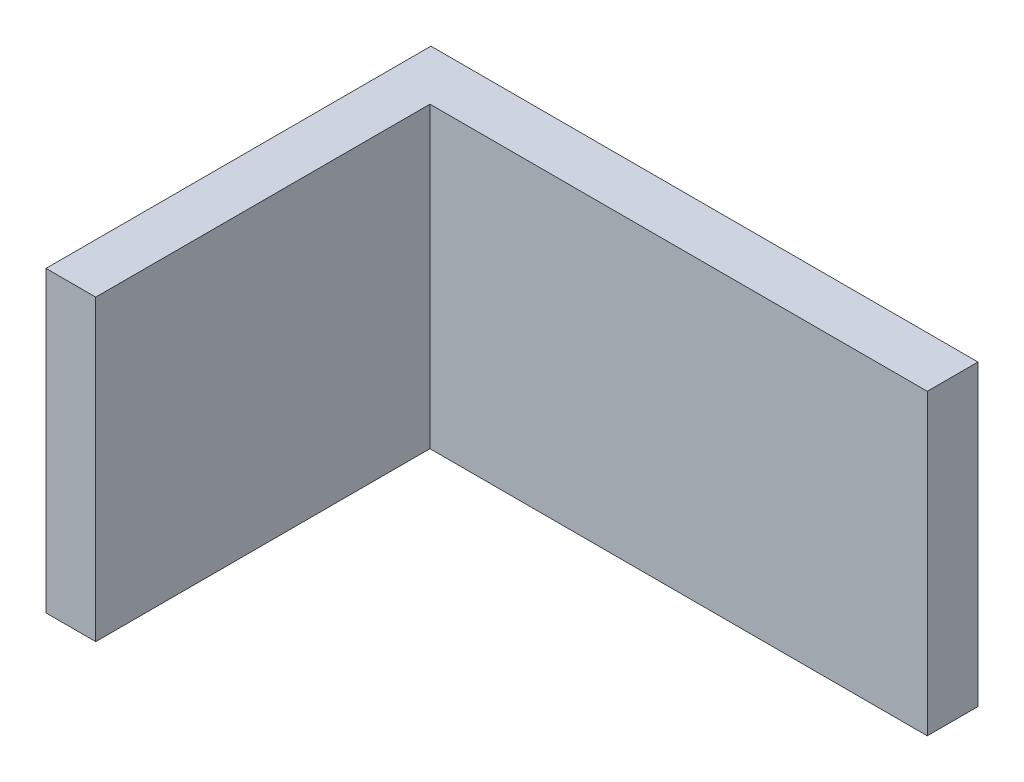
ISO-10303-21;
HEADER;
FILE_DESCRIPTION(('STEP AP214'),'2;1');
FILE_NAME('part.step','',(''),(''),'','','');
FILE_SCHEMA(('AUTOMOTIVE_DESIGN { 1 0 10303 214 1 1 1 1 }'));
ENDSEC;
DATA;
#1=APPLICATION_CONTEXT('core data for automotive mechanical design processes');
#2=APPLICATION_PROTOCOL_DEFINITION('international standard','automotive_design',2000,#1);
#3=PRODUCT_CONTEXT('',#1,'mechanical');
#4=PRODUCT('Part','Part','',(#3));
#5=PRODUCT_RELATED_PRODUCT_CATEGORY('part','',(#4));
#6=PRODUCT_DEFINITION_FORMATION('','',#4);
#7=PRODUCT_DEFINITION_CONTEXT('part definition',#1,'design');
#8=PRODUCT_DEFINITION('design','',#6,#7);
#9=PRODUCT_DEFINITION_SHAPE('','',#8);
#10=(LENGTH_UNIT() NAMED_UNIT(*) SI_UNIT(.MILLI.,.METRE.));
#11=(NAMED_UNIT(*) PLANE_ANGLE_UNIT() SI_UNIT($,.RADIAN.));
#12=(NAMED_UNIT(*) SI_UNIT($,.STERADIAN.) SOLID_ANGLE_UNIT());
#13=UNCERTAINTY_MEASURE_WITH_UNIT(LENGTH_MEASURE(1.E-05),#10,'distance_accuracy_value','');
#14=(GEOMETRIC_REPRESENTATION_CONTEXT(3) GLOBAL_UNCERTAINTY_ASSIGNED_CONTEXT((#13)) GLOBAL_UNIT_ASSIGNED_CONTEXT((#10,
#11,#12)) REPRESENTATION_CONTEXT('',''));
#15=CARTESIAN_POINT('',(0.,0.,0.));
#16=DIRECTION('',(0.,0.,1.));
#17=DIRECTION('',(1.,0.,0.));
#18=AXIS2_PLACEMENT_3D('',#15,#16,#17);
#19=CARTESIAN_POINT('',(-4.55,-1.9,0.));
#20=DIRECTION('',(0.,-1.,0.));
#21=DIRECTION('',(0.,0.,1.));
#22=AXIS2_PLACEMENT_3D('',#19,#20,#21);
#23=PLANE('',#22);
#24=DIRECTION('',(-1.,0.,0.));
#25=VECTOR('',#24,1.);
#26=CARTESIAN_POINT('',(-4.,-1.9,0.));
#27=LINE('',#26,#25);
#28=CARTESIAN_POINT('',(-4.,-1.9,0.));
#29=VERTEX_POINT('',#28);
#30=CARTESIAN_POINT('',(-4.55,-1.9,0.));
#31=VERTEX_POINT('',#30);
#32=EDGE_CURVE('E11',#29,#31,#27,.T.);
#33=ORIENTED_EDGE('',*,*,#32,.F.);
#34=DIRECTION('',(0.,0.,-1.));
#35=VECTOR('',#34,1.);
#36=CARTESIAN_POINT('',(-4.,-1.9,0.051));
#37=LINE('',#36,#35);
#38=CARTESIAN_POINT('',(-4.,-1.9,0.051));
#39=VERTEX_POINT('',#38);
#40=EDGE_CURVE('E24',#39,#29,#37,.T.);
#41=ORIENTED_EDGE('',*,*,#40,.F.);
#42=DIRECTION('',(1.,0.,0.));
#43=VECTOR('',#42,1.);
#44=CARTESIAN_POINT('',(-4.5,-1.9,0.051));
#45=LINE('',#44,#43);
#46=CARTESIAN_POINT('',(-4.5,-1.9,0.051));
#47=VERTEX_POINT('',#46);
#48=EDGE_CURVE('E87',#47,#39,#45,.T.);
#49=ORIENTED_EDGE('',*,*,#48,.F.);
#50=DIRECTION('',(0.,0.,-1.));
#51=VECTOR('',#50,1.);
#52=CARTESIAN_POINT('',(-4.5,-1.9,0.387));
#53=LINE('',#52,#51);
#54=CARTESIAN_POINT('',(-4.5,-1.9,0.387));
#55=VERTEX_POINT('',#54);
#56=EDGE_CURVE('E114',#55,#47,#53,.T.);
#57=ORIENTED_EDGE('',*,*,#56,.F.);
#58=DIRECTION('',(1.,0.,0.));
#59=VECTOR('',#58,1.);
#60=CARTESIAN_POINT('',(-4.55,-1.9,0.387));
#61=LINE('',#60,#59);
#62=CARTESIAN_POINT('',(-4.55,-1.9,0.387));
#63=VERTEX_POINT('',#62);
#64=EDGE_CURVE('E111',#63,#55,#61,.T.);
#65=ORIENTED_EDGE('',*,*,#64,.F.);
#66=DIRECTION('',(0.,0.,1.));
#67=VECTOR('',#66,1.);
#68=CARTESIAN_POINT('',(-4.55,-1.9,0.));
#69=LINE('',#68,#67);
#70=EDGE_CURVE('E108',#31,#63,#69,.T.);
#71=ORIENTED_EDGE('',*,*,#70,.F.);
#72=EDGE_LOOP('',(#33,#41,#49,#57,#65,#71));
#73=FACE_BOUND('',#72,.T.);
#74=ADVANCED_FACE('F17',(#73),#23,.T.);
#75=CARTESIAN_POINT('',(-4.,-1.6,0.));
#76=DIRECTION('',(0.,1.,0.));
#77=DIRECTION('',(0.,0.,1.));
#78=AXIS2_PLACEMENT_3D('',#75,#76,#77);
#79=PLANE('',#78);
#80=DIRECTION('',(1.,0.,0.));
#81=VECTOR('',#80,1.);
#82=CARTESIAN_POINT('',(-4.55,-1.6,0.));
#83=LINE('',#82,#81);
#84=CARTESIAN_POINT('',(-4.55,-1.6,0.));
#85=VERTEX_POINT('',#84);
#86=CARTESIAN_POINT('',(-4.,-1.6,0.));
#87=VERTEX_POINT('',#86);
#88=EDGE_CURVE('E106',#85,#87,#83,.T.);
#89=ORIENTED_EDGE('',*,*,#88,.F.);
#90=DIRECTION('',(0.,0.,-1.));
#91=VECTOR('',#90,1.);
#92=CARTESIAN_POINT('',(-4.55,-1.6,0.387));
#93=LINE('',#92,#91);
#94=CARTESIAN_POINT('',(-4.55,-1.6,0.387));
#95=VERTEX_POINT('',#94);
#96=EDGE_CURVE('E103',#95,#85,#93,.T.);
#97=ORIENTED_EDGE('',*,*,#96,.F.);
#98=DIRECTION('',(-1.,0.,0.));
#99=VECTOR('',#98,1.);
#100=CARTESIAN_POINT('',(-4.5,-1.6,0.387));
#101=LINE('',#100,#99);
#102=CARTESIAN_POINT('',(-4.5,-1.6,0.387));
#103=VERTEX_POINT('',#102);
#104=EDGE_CURVE('E100',#103,#95,#101,.T.);
#105=ORIENTED_EDGE('',*,*,#104,.F.);
#106=DIRECTION('',(0.,0.,1.));
#107=VECTOR('',#106,1.);
#108=CARTESIAN_POINT('',(-4.5,-1.6,0.051));
#109=LINE('',#108,#107);
#110=CARTESIAN_POINT('',(-4.5,-1.6,0.051));
#111=VERTEX_POINT('',#110);
#112=EDGE_CURVE('E72',#111,#103,#109,.T.);
#113=ORIENTED_EDGE('',*,*,#112,.F.);
#114=DIRECTION('',(-1.,0.,0.));
#115=VECTOR('',#114,1.);
#116=CARTESIAN_POINT('',(-4.,-1.6,0.051));
#117=LINE('',#116,#115);
#118=CARTESIAN_POINT('',(-4.,-1.6,0.051));
#119=VERTEX_POINT('',#118);
#120=EDGE_CURVE('E66',#119,#111,#117,.T.);
#121=ORIENTED_EDGE('',*,*,#120,.F.);
#122=DIRECTION('',(0.,0.,1.));
#123=VECTOR('',#122,1.);
#124=CARTESIAN_POINT('',(-4.,-1.6,0.));
#125=LINE('',#124,#123);
#126=EDGE_CURVE('E69',#87,#119,#125,.T.);
#127=ORIENTED_EDGE('',*,*,#126,.F.);
#128=EDGE_LOOP('',(#89,#97,#105,#113,#121,#127));
#129=FACE_BOUND('',#128,.T.);
#130=ADVANCED_FACE('F68',(#129),#79,.T.);
#131=CARTESIAN_POINT('',(-4.55,-1.9,0.387));
#132=DIRECTION('',(0.,0.,1.));
#133=DIRECTION('',(0.,1.,0.));
#134=AXIS2_PLACEMENT_3D('',#131,#132,#133);
#135=PLANE('',#134);
#136=ORIENTED_EDGE('',*,*,#64,.T.);
#137=DIRECTION('',(0.,-1.,0.));
#138=VECTOR('',#137,1.);
#139=CARTESIAN_POINT('',(-4.5,-1.6,0.387));
#140=LINE('',#139,#138);
#141=EDGE_CURVE('E83',#103,#55,#140,.T.);
#142=ORIENTED_EDGE('',*,*,#141,.F.);
#143=ORIENTED_EDGE('',*,*,#104,.T.);
#144=DIRECTION('',(0.,1.,0.));
#145=VECTOR('',#144,1.);
#146=CARTESIAN_POINT('',(-4.55,-1.9,0.387));
#147=LINE('',#146,#145);
#148=EDGE_CURVE('E88',#63,#95,#147,.T.);
#149=ORIENTED_EDGE('',*,*,#148,.F.);
#150=EDGE_LOOP('',(#136,#142,#143,#149));
#151=FACE_BOUND('',#150,.T.);
#152=ADVANCED_FACE('F125',(#151),#135,.T.);
#153=CARTESIAN_POINT('',(-4.5,-1.9,0.051));
#154=DIRECTION('',(0.,0.,1.));
#155=DIRECTION('',(0.,1.,0.));
#156=AXIS2_PLACEMENT_3D('',#153,#154,#155);
#157=PLANE('',#156);
#158=ORIENTED_EDGE('',*,*,#48,.T.);
#159=DIRECTION('',(0.,-1.,0.));
#160=VECTOR('',#159,1.);
#161=CARTESIAN_POINT('',(-4.,-1.6,0.051));
#162=LINE('',#161,#160);
#163=EDGE_CURVE('E81',#119,#39,#162,.T.);
#164=ORIENTED_EDGE('',*,*,#163,.F.);
#165=ORIENTED_EDGE('',*,*,#120,.T.);
#166=DIRECTION('',(0.,1.,0.));
#167=VECTOR('',#166,1.);
#168=CARTESIAN_POINT('',(-4.5,-1.9,0.051));
#169=LINE('',#168,#167);
#170=EDGE_CURVE('E89',#47,#111,#169,.T.);
#171=ORIENTED_EDGE('',*,*,#170,.F.);
#172=EDGE_LOOP('',(#158,#164,#165,#171));
#173=FACE_BOUND('',#172,.T.);
#174=ADVANCED_FACE('F86',(#173),#157,.T.);
#175=CARTESIAN_POINT('',(-4.55,-1.6,0.));
#176=DIRECTION('',(-1.,0.,0.));
#177=DIRECTION('',(0.,0.,1.));
#178=AXIS2_PLACEMENT_3D('',#175,#176,#177);
#179=PLANE('',#178);
#180=DIRECTION('',(0.,1.,0.));
#181=VECTOR('',#180,1.);
#182=CARTESIAN_POINT('',(-4.55,-1.9,0.));
#183=LINE('',#182,#181);
#184=EDGE_CURVE('E93',#31,#85,#183,.T.);
#185=ORIENTED_EDGE('',*,*,#184,.F.);
#186=ORIENTED_EDGE('',*,*,#70,.T.);
#187=ORIENTED_EDGE('',*,*,#148,.T.);
#188=ORIENTED_EDGE('',*,*,#96,.T.);
#189=EDGE_LOOP('',(#185,#186,#187,#188));
#190=FACE_BOUND('',#189,.T.);
#191=ADVANCED_FACE('F121',(#190),#179,.T.);
#192=CARTESIAN_POINT('',(-4.,-1.9,0.));
#193=DIRECTION('',(1.,0.,0.));
#194=DIRECTION('',(0.,0.,1.));
#195=AXIS2_PLACEMENT_3D('',#192,#193,#194);
#196=PLANE('',#195);
#197=DIRECTION('',(0.,-1.,0.));
#198=VECTOR('',#197,1.);
#199=CARTESIAN_POINT('',(-4.,-1.6,0.));
#200=LINE('',#199,#198);
#201=EDGE_CURVE('E82',#87,#29,#200,.T.);
#202=ORIENTED_EDGE('',*,*,#201,.F.);
#203=ORIENTED_EDGE('',*,*,#126,.T.);
#204=ORIENTED_EDGE('',*,*,#163,.T.);
#205=ORIENTED_EDGE('',*,*,#40,.T.);
#206=EDGE_LOOP('',(#202,#203,#204,#205));
#207=FACE_BOUND('',#206,.T.);
#208=ADVANCED_FACE('F80',(#207),#196,.T.);
#209=CARTESIAN_POINT('',(-4.5,-1.9,0.051));
#210=DIRECTION('',(1.,0.,0.));
#211=DIRECTION('',(0.,0.,1.));
#212=AXIS2_PLACEMENT_3D('',#209,#210,#211);
#213=PLANE('',#212);
#214=ORIENTED_EDGE('',*,*,#170,.T.);
#215=ORIENTED_EDGE('',*,*,#112,.T.);
#216=ORIENTED_EDGE('',*,*,#141,.T.);
#217=ORIENTED_EDGE('',*,*,#56,.T.);
#218=EDGE_LOOP('',(#214,#215,#216,#217));
#219=FACE_BOUND('',#218,.T.);
#220=ADVANCED_FACE('F127',(#219),#213,.T.);
#221=CARTESIAN_POINT('',(-4.55,-1.6,0.));
#222=DIRECTION('',(0.,0.,-1.));
#223=DIRECTION('',(0.,1.,0.));
#224=AXIS2_PLACEMENT_3D('',#221,#222,#223);
#225=PLANE('',#224);
#226=ORIENTED_EDGE('',*,*,#88,.T.);
#227=ORIENTED_EDGE('',*,*,#201,.T.);
#228=ORIENTED_EDGE('',*,*,#32,.T.);
#229=ORIENTED_EDGE('',*,*,#184,.T.);
#230=EDGE_LOOP('',(#226,#227,#228,#229));
#231=FACE_BOUND('',#230,.T.);
#232=ADVANCED_FACE('F117',(#231),#225,.T.);
#233=CLOSED_SHELL('',(#74,#130,#152,#174,#191,#208,#220,#232));
#234=MANIFOLD_SOLID_BREP('B1',#233);
#235=ADVANCED_BREP_SHAPE_REPRESENTATION('',(#18,#234),#14);
#236=SHAPE_DEFINITION_REPRESENTATION(#9,#235);
ENDSEC;
END-ISO-10303-21;
